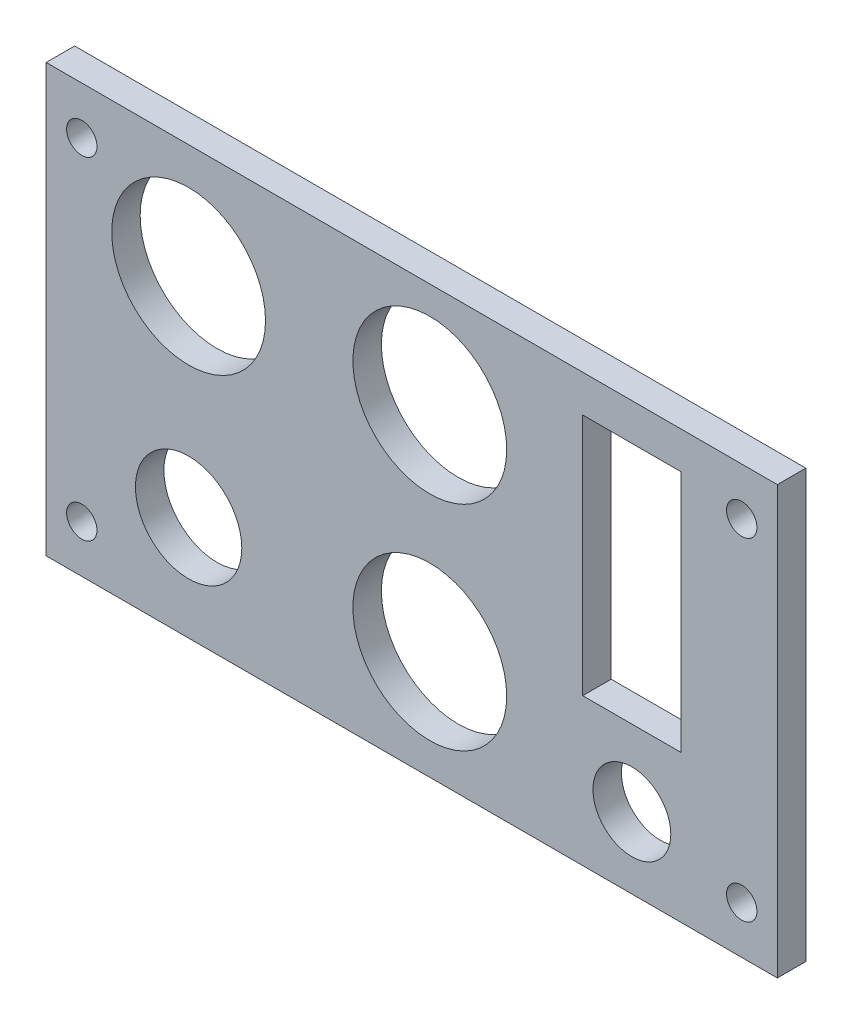
ISO-10303-21;
HEADER;
FILE_DESCRIPTION(('STEP AP214'),'2;1');
FILE_NAME('part.step','',(''),(''),'','','');
FILE_SCHEMA(('AUTOMOTIVE_DESIGN { 1 0 10303 214 1 1 1 1 }'));
ENDSEC;
DATA;
#1=APPLICATION_CONTEXT('core data for automotive mechanical design processes');
#2=APPLICATION_PROTOCOL_DEFINITION('international standard','automotive_design',2000,#1);
#3=PRODUCT_CONTEXT('',#1,'mechanical');
#4=PRODUCT('Part','Part','',(#3));
#5=PRODUCT_RELATED_PRODUCT_CATEGORY('part','',(#4));
#6=PRODUCT_DEFINITION_FORMATION('','',#4);
#7=PRODUCT_DEFINITION_CONTEXT('part definition',#1,'design');
#8=PRODUCT_DEFINITION('design','',#6,#7);
#9=PRODUCT_DEFINITION_SHAPE('','',#8);
#10=(LENGTH_UNIT() NAMED_UNIT(*) SI_UNIT(.MILLI.,.METRE.));
#11=(NAMED_UNIT(*) PLANE_ANGLE_UNIT() SI_UNIT($,.RADIAN.));
#12=(NAMED_UNIT(*) SI_UNIT($,.STERADIAN.) SOLID_ANGLE_UNIT());
#13=UNCERTAINTY_MEASURE_WITH_UNIT(LENGTH_MEASURE(1.E-05),#10,'distance_accuracy_value','');
#14=(GEOMETRIC_REPRESENTATION_CONTEXT(3) GLOBAL_UNCERTAINTY_ASSIGNED_CONTEXT((#13)) GLOBAL_UNIT_ASSIGNED_CONTEXT((#10,
#11,#12)) REPRESENTATION_CONTEXT('',''));
#15=CARTESIAN_POINT('',(0.,0.,0.));
#16=DIRECTION('',(0.,0.,1.));
#17=DIRECTION('',(1.,0.,0.));
#18=AXIS2_PLACEMENT_3D('',#15,#16,#17);
#19=CARTESIAN_POINT('',(0.,0.,3.));
#20=DIRECTION('',(1.,0.,0.));
#21=DIRECTION('',(0.,0.,-1.));
#22=AXIS2_PLACEMENT_3D('',#19,#20,#21);
#23=PLANE('',#22);
#24=DIRECTION('',(0.,-1.,0.));
#25=VECTOR('',#24,1.);
#26=CARTESIAN_POINT('',(0.,0.,0.));
#27=LINE('',#26,#25);
#28=CARTESIAN_POINT('',(0.,45.,0.));
#29=VERTEX_POINT('',#28);
#30=CARTESIAN_POINT('',(0.,0.,0.));
#31=VERTEX_POINT('',#30);
#32=EDGE_CURVE('E140',#29,#31,#27,.T.);
#33=ORIENTED_EDGE('',*,*,#32,.T.);
#34=DIRECTION('',(0.,0.,-1.));
#35=VECTOR('',#34,1.);
#36=CARTESIAN_POINT('',(0.,0.,3.));
#37=LINE('',#36,#35);
#38=CARTESIAN_POINT('',(0.,0.,3.));
#39=VERTEX_POINT('',#38);
#40=EDGE_CURVE('E11',#39,#31,#37,.T.);
#41=ORIENTED_EDGE('',*,*,#40,.F.);
#42=DIRECTION('',(0.,-1.,0.));
#43=VECTOR('',#42,1.);
#44=CARTESIAN_POINT('',(0.,0.,3.));
#45=LINE('',#44,#43);
#46=CARTESIAN_POINT('',(0.,45.,3.));
#47=VERTEX_POINT('',#46);
#48=EDGE_CURVE('E143',#47,#39,#45,.T.);
#49=ORIENTED_EDGE('',*,*,#48,.F.);
#50=DIRECTION('',(0.,0.,-1.));
#51=VECTOR('',#50,1.);
#52=CARTESIAN_POINT('',(0.,45.,3.));
#53=LINE('',#52,#51);
#54=EDGE_CURVE('E153',#47,#29,#53,.T.);
#55=ORIENTED_EDGE('',*,*,#54,.T.);
#56=EDGE_LOOP('',(#33,#41,#49,#55));
#57=FACE_BOUND('',#56,.T.);
#58=ADVANCED_FACE('F32',(#57),#23,.F.);
#59=CARTESIAN_POINT('',(0.,0.,3.));
#60=DIRECTION('',(0.,1.,0.));
#61=DIRECTION('',(0.,0.,1.));
#62=AXIS2_PLACEMENT_3D('',#59,#60,#61);
#63=PLANE('',#62);
#64=DIRECTION('',(1.,0.,0.));
#65=VECTOR('',#64,1.);
#66=CARTESIAN_POINT('',(0.,0.,0.));
#67=LINE('',#66,#65);
#68=CARTESIAN_POINT('',(77.,0.,0.));
#69=VERTEX_POINT('',#68);
#70=EDGE_CURVE('E156',#31,#69,#67,.T.);
#71=ORIENTED_EDGE('',*,*,#70,.T.);
#72=DIRECTION('',(0.,0.,-1.));
#73=VECTOR('',#72,1.);
#74=CARTESIAN_POINT('',(77.,0.,3.));
#75=LINE('',#74,#73);
#76=CARTESIAN_POINT('',(77.,0.,3.));
#77=VERTEX_POINT('',#76);
#78=EDGE_CURVE('E39',#77,#69,#75,.T.);
#79=ORIENTED_EDGE('',*,*,#78,.F.);
#80=DIRECTION('',(1.,0.,0.));
#81=VECTOR('',#80,1.);
#82=CARTESIAN_POINT('',(0.,0.,3.));
#83=LINE('',#82,#81);
#84=EDGE_CURVE('E146',#39,#77,#83,.T.);
#85=ORIENTED_EDGE('',*,*,#84,.F.);
#86=ORIENTED_EDGE('',*,*,#40,.T.);
#87=EDGE_LOOP('',(#71,#79,#85,#86));
#88=FACE_BOUND('',#87,.T.);
#89=ADVANCED_FACE('F185',(#88),#63,.F.);
#90=CARTESIAN_POINT('',(77.,0.,3.));
#91=DIRECTION('',(-1.,0.,0.));
#92=DIRECTION('',(0.,-1.,0.));
#93=AXIS2_PLACEMENT_3D('',#90,#91,#92);
#94=PLANE('',#93);
#95=DIRECTION('',(0.,1.,0.));
#96=VECTOR('',#95,1.);
#97=CARTESIAN_POINT('',(77.,0.,0.));
#98=LINE('',#97,#96);
#99=CARTESIAN_POINT('',(77.,45.,0.));
#100=VERTEX_POINT('',#99);
#101=EDGE_CURVE('E158',#69,#100,#98,.T.);
#102=ORIENTED_EDGE('',*,*,#101,.T.);
#103=DIRECTION('',(0.,0.,-1.));
#104=VECTOR('',#103,1.);
#105=CARTESIAN_POINT('',(77.,45.,3.));
#106=LINE('',#105,#104);
#107=CARTESIAN_POINT('',(77.,45.,3.));
#108=VERTEX_POINT('',#107);
#109=EDGE_CURVE('E163',#108,#100,#106,.T.);
#110=ORIENTED_EDGE('',*,*,#109,.F.);
#111=DIRECTION('',(0.,1.,0.));
#112=VECTOR('',#111,1.);
#113=CARTESIAN_POINT('',(77.,0.,3.));
#114=LINE('',#113,#112);
#115=EDGE_CURVE('E149',#77,#108,#114,.T.);
#116=ORIENTED_EDGE('',*,*,#115,.F.);
#117=ORIENTED_EDGE('',*,*,#78,.T.);
#118=EDGE_LOOP('',(#102,#110,#116,#117));
#119=FACE_BOUND('',#118,.T.);
#120=ADVANCED_FACE('F170',(#119),#94,.F.);
#121=CARTESIAN_POINT('',(0.,45.,3.));
#122=DIRECTION('',(0.,-1.,0.));
#123=DIRECTION('',(0.,0.,-1.));
#124=AXIS2_PLACEMENT_3D('',#121,#122,#123);
#125=PLANE('',#124);
#126=DIRECTION('',(-1.,0.,0.));
#127=VECTOR('',#126,1.);
#128=CARTESIAN_POINT('',(0.,45.,0.));
#129=LINE('',#128,#127);
#130=EDGE_CURVE('E147',#100,#29,#129,.T.);
#131=ORIENTED_EDGE('',*,*,#130,.T.);
#132=ORIENTED_EDGE('',*,*,#54,.F.);
#133=DIRECTION('',(-1.,0.,0.));
#134=VECTOR('',#133,1.);
#135=CARTESIAN_POINT('',(0.,45.,3.));
#136=LINE('',#135,#134);
#137=EDGE_CURVE('E151',#108,#47,#136,.T.);
#138=ORIENTED_EDGE('',*,*,#137,.F.);
#139=ORIENTED_EDGE('',*,*,#109,.T.);
#140=EDGE_LOOP('',(#131,#132,#138,#139));
#141=FACE_BOUND('',#140,.T.);
#142=ADVANCED_FACE('F178',(#141),#125,.F.);
#143=CARTESIAN_POINT('',(0.,45.,3.));
#144=DIRECTION('',(0.,0.,-1.));
#145=DIRECTION('',(-1.,0.,0.));
#146=AXIS2_PLACEMENT_3D('',#143,#144,#145);
#147=PLANE('',#146);
#148=CARTESIAN_POINT('',(3.74999999999999,40.,3.));
#149=DIRECTION('',(0.,0.,1.));
#150=DIRECTION('',(1.,0.,0.));
#151=AXIS2_PLACEMENT_3D('',#148,#149,#150);
#152=CIRCLE('',#151,1.6);
#153=CARTESIAN_POINT('',(5.34999999999999,40.,3.));
#154=VERTEX_POINT('',#153);
#155=EDGE_CURVE('E256',#154,#154,#152,.T.);
#156=ORIENTED_EDGE('',*,*,#155,.F.);
#157=EDGE_LOOP('',(#156));
#158=FACE_BOUND('',#157,.T.);
#159=CARTESIAN_POINT('',(3.74999999999999,4.99999999999999,3.));
#160=DIRECTION('',(0.,0.,1.));
#161=DIRECTION('',(1.,0.,0.));
#162=AXIS2_PLACEMENT_3D('',#159,#160,#161);
#163=CIRCLE('',#162,1.6);
#164=CARTESIAN_POINT('',(5.34999999999999,4.99999999999999,3.));
#165=VERTEX_POINT('',#164);
#166=EDGE_CURVE('E260',#165,#165,#163,.T.);
#167=ORIENTED_EDGE('',*,*,#166,.F.);
#168=EDGE_LOOP('',(#167));
#169=FACE_BOUND('',#168,.T.);
#170=CARTESIAN_POINT('',(73.25,4.99999999999999,3.));
#171=DIRECTION('',(0.,0.,1.));
#172=DIRECTION('',(1.,0.,0.));
#173=AXIS2_PLACEMENT_3D('',#170,#171,#172);
#174=CIRCLE('',#173,1.60000000000001);
#175=CARTESIAN_POINT('',(74.85,4.99999999999999,3.));
#176=VERTEX_POINT('',#175);
#177=EDGE_CURVE('E267',#176,#176,#174,.T.);
#178=ORIENTED_EDGE('',*,*,#177,.F.);
#179=EDGE_LOOP('',(#178));
#180=FACE_BOUND('',#179,.T.);
#181=CARTESIAN_POINT('',(73.25,40.,3.));
#182=DIRECTION('',(0.,0.,1.));
#183=DIRECTION('',(1.,0.,0.));
#184=AXIS2_PLACEMENT_3D('',#181,#182,#183);
#185=CIRCLE('',#184,1.60000000000001);
#186=CARTESIAN_POINT('',(74.85,40.,3.));
#187=VERTEX_POINT('',#186);
#188=EDGE_CURVE('E273',#187,#187,#185,.T.);
#189=ORIENTED_EDGE('',*,*,#188,.F.);
#190=EDGE_LOOP('',(#189));
#191=FACE_BOUND('',#190,.T.);
#192=CARTESIAN_POINT('',(40.4,11.45,3.));
#193=DIRECTION('',(0.,0.,1.));
#194=DIRECTION('',(1.,0.,0.));
#195=AXIS2_PLACEMENT_3D('',#192,#193,#194);
#196=CIRCLE('',#195,8.1);
#197=CARTESIAN_POINT('',(48.5,11.45,3.));
#198=VERTEX_POINT('',#197);
#199=EDGE_CURVE('E279',#198,#198,#196,.T.);
#200=ORIENTED_EDGE('',*,*,#199,.F.);
#201=EDGE_LOOP('',(#200));
#202=FACE_BOUND('',#201,.T.);
#203=CARTESIAN_POINT('',(40.4,33.95,3.));
#204=DIRECTION('',(0.,0.,1.));
#205=DIRECTION('',(1.,0.,0.));
#206=AXIS2_PLACEMENT_3D('',#203,#204,#205);
#207=CIRCLE('',#206,8.1);
#208=CARTESIAN_POINT('',(48.5,33.95,3.));
#209=VERTEX_POINT('',#208);
#210=EDGE_CURVE('E285',#209,#209,#207,.T.);
#211=ORIENTED_EDGE('',*,*,#210,.F.);
#212=EDGE_LOOP('',(#211));
#213=FACE_BOUND('',#212,.T.);
#214=CARTESIAN_POINT('',(61.68,7.5,3.));
#215=DIRECTION('',(0.,0.,1.));
#216=DIRECTION('',(1.,0.,0.));
#217=AXIS2_PLACEMENT_3D('',#214,#215,#216);
#218=CIRCLE('',#217,4.1);
#219=CARTESIAN_POINT('',(65.78,7.5,3.));
#220=VERTEX_POINT('',#219);
#221=EDGE_CURVE('E291',#220,#220,#218,.T.);
#222=ORIENTED_EDGE('',*,*,#221,.F.);
#223=EDGE_LOOP('',(#222));
#224=FACE_BOUND('',#223,.T.);
#225=DIRECTION('',(-1.,0.,0.));
#226=VECTOR('',#225,1.);
#227=CARTESIAN_POINT('',(66.86,41.1,3.));
#228=LINE('',#227,#226);
#229=CARTESIAN_POINT('',(66.86,41.1,3.));
#230=VERTEX_POINT('',#229);
#231=CARTESIAN_POINT('',(56.5,41.1,3.));
#232=VERTEX_POINT('',#231);
#233=EDGE_CURVE('E115',#230,#232,#228,.T.);
#234=ORIENTED_EDGE('',*,*,#233,.F.);
#235=DIRECTION('',(0.,1.,0.));
#236=VECTOR('',#235,1.);
#237=CARTESIAN_POINT('',(66.86,41.1,3.));
#238=LINE('',#237,#236);
#239=CARTESIAN_POINT('',(66.86,15.5,3.));
#240=VERTEX_POINT('',#239);
#241=EDGE_CURVE('E46',#240,#230,#238,.T.);
#242=ORIENTED_EDGE('',*,*,#241,.F.);
#243=DIRECTION('',(1.,0.,0.));
#244=VECTOR('',#243,1.);
#245=CARTESIAN_POINT('',(66.86,15.5,3.));
#246=LINE('',#245,#244);
#247=CARTESIAN_POINT('',(56.5,15.5,3.));
#248=VERTEX_POINT('',#247);
#249=EDGE_CURVE('E108',#248,#240,#246,.T.);
#250=ORIENTED_EDGE('',*,*,#249,.F.);
#251=DIRECTION('',(0.,-1.,0.));
#252=VECTOR('',#251,1.);
#253=CARTESIAN_POINT('',(56.5,41.1,3.));
#254=LINE('',#253,#252);
#255=EDGE_CURVE('E122',#232,#248,#254,.T.);
#256=ORIENTED_EDGE('',*,*,#255,.F.);
#257=EDGE_LOOP('',(#234,#242,#250,#256));
#258=FACE_BOUND('',#257,.T.);
#259=CARTESIAN_POINT('',(15.,11.,3.));
#260=DIRECTION('',(0.,0.,1.));
#261=DIRECTION('',(1.,0.,0.));
#262=AXIS2_PLACEMENT_3D('',#259,#260,#261);
#263=CIRCLE('',#262,5.6);
#264=CARTESIAN_POINT('',(20.6,11.,3.));
#265=VERTEX_POINT('',#264);
#266=EDGE_CURVE('E131',#265,#265,#263,.T.);
#267=ORIENTED_EDGE('',*,*,#266,.F.);
#268=EDGE_LOOP('',(#267));
#269=FACE_BOUND('',#268,.T.);
#270=CARTESIAN_POINT('',(15.,33.,3.));
#271=DIRECTION('',(0.,0.,1.));
#272=DIRECTION('',(1.,0.,0.));
#273=AXIS2_PLACEMENT_3D('',#270,#271,#272);
#274=CIRCLE('',#273,8.1);
#275=CARTESIAN_POINT('',(23.1,33.,3.));
#276=VERTEX_POINT('',#275);
#277=EDGE_CURVE('E137',#276,#276,#274,.T.);
#278=ORIENTED_EDGE('',*,*,#277,.F.);
#279=EDGE_LOOP('',(#278));
#280=FACE_BOUND('',#279,.T.);
#281=ORIENTED_EDGE('',*,*,#48,.T.);
#282=ORIENTED_EDGE('',*,*,#84,.T.);
#283=ORIENTED_EDGE('',*,*,#115,.T.);
#284=ORIENTED_EDGE('',*,*,#137,.T.);
#285=EDGE_LOOP('',(#281,#282,#283,#284));
#286=FACE_BOUND('',#285,.T.);
#287=ADVANCED_FACE('F184',(#158,#169,#180,#191,#202,#213,#224,#258,#269,#280,#286),#147,.F.);
#288=CARTESIAN_POINT('',(0.,45.,0.));
#289=DIRECTION('',(0.,0.,-1.));
#290=DIRECTION('',(-1.,0.,0.));
#291=AXIS2_PLACEMENT_3D('',#288,#289,#290);
#292=PLANE('',#291);
#293=CARTESIAN_POINT('',(3.74999999999999,40.,0.));
#294=DIRECTION('',(0.,0.,-1.));
#295=DIRECTION('',(-1.,0.,0.));
#296=AXIS2_PLACEMENT_3D('',#293,#294,#295);
#297=CIRCLE('',#296,1.6);
#298=CARTESIAN_POINT('',(2.14999999999999,40.,0.));
#299=VERTEX_POINT('',#298);
#300=EDGE_CURVE('E253',#299,#299,#297,.F.);
#301=ORIENTED_EDGE('',*,*,#300,.T.);
#302=EDGE_LOOP('',(#301));
#303=FACE_BOUND('',#302,.T.);
#304=CARTESIAN_POINT('',(3.74999999999999,4.99999999999999,0.));
#305=DIRECTION('',(0.,0.,-1.));
#306=DIRECTION('',(-1.,0.,0.));
#307=AXIS2_PLACEMENT_3D('',#304,#305,#306);
#308=CIRCLE('',#307,1.6);
#309=CARTESIAN_POINT('',(2.14999999999999,4.99999999999999,0.));
#310=VERTEX_POINT('',#309);
#311=EDGE_CURVE('E257',#310,#310,#308,.F.);
#312=ORIENTED_EDGE('',*,*,#311,.T.);
#313=EDGE_LOOP('',(#312));
#314=FACE_BOUND('',#313,.T.);
#315=CARTESIAN_POINT('',(73.25,4.99999999999999,0.));
#316=DIRECTION('',(0.,0.,-1.));
#317=DIRECTION('',(-1.,0.,0.));
#318=AXIS2_PLACEMENT_3D('',#315,#316,#317);
#319=CIRCLE('',#318,1.60000000000001);
#320=CARTESIAN_POINT('',(71.65,4.99999999999999,0.));
#321=VERTEX_POINT('',#320);
#322=EDGE_CURVE('E265',#321,#321,#319,.F.);
#323=ORIENTED_EDGE('',*,*,#322,.T.);
#324=EDGE_LOOP('',(#323));
#325=FACE_BOUND('',#324,.T.);
#326=CARTESIAN_POINT('',(73.25,40.,0.));
#327=DIRECTION('',(0.,0.,-1.));
#328=DIRECTION('',(-1.,0.,0.));
#329=AXIS2_PLACEMENT_3D('',#326,#327,#328);
#330=CIRCLE('',#329,1.60000000000001);
#331=CARTESIAN_POINT('',(71.65,40.,0.));
#332=VERTEX_POINT('',#331);
#333=EDGE_CURVE('E270',#332,#332,#330,.F.);
#334=ORIENTED_EDGE('',*,*,#333,.T.);
#335=EDGE_LOOP('',(#334));
#336=FACE_BOUND('',#335,.T.);
#337=CARTESIAN_POINT('',(40.4,11.45,0.));
#338=DIRECTION('',(0.,0.,-1.));
#339=DIRECTION('',(-1.,0.,0.));
#340=AXIS2_PLACEMENT_3D('',#337,#338,#339);
#341=CIRCLE('',#340,8.1);
#342=CARTESIAN_POINT('',(32.3,11.45,0.));
#343=VERTEX_POINT('',#342);
#344=EDGE_CURVE('E276',#343,#343,#341,.F.);
#345=ORIENTED_EDGE('',*,*,#344,.T.);
#346=EDGE_LOOP('',(#345));
#347=FACE_BOUND('',#346,.T.);
#348=CARTESIAN_POINT('',(40.4,33.95,0.));
#349=DIRECTION('',(0.,0.,-1.));
#350=DIRECTION('',(-1.,0.,0.));
#351=AXIS2_PLACEMENT_3D('',#348,#349,#350);
#352=CIRCLE('',#351,8.1);
#353=CARTESIAN_POINT('',(32.3,33.95,0.));
#354=VERTEX_POINT('',#353);
#355=EDGE_CURVE('E282',#354,#354,#352,.F.);
#356=ORIENTED_EDGE('',*,*,#355,.T.);
#357=EDGE_LOOP('',(#356));
#358=FACE_BOUND('',#357,.T.);
#359=CARTESIAN_POINT('',(61.68,7.5,0.));
#360=DIRECTION('',(0.,0.,-1.));
#361=DIRECTION('',(-1.,0.,0.));
#362=AXIS2_PLACEMENT_3D('',#359,#360,#361);
#363=CIRCLE('',#362,4.1);
#364=CARTESIAN_POINT('',(57.58,7.5,0.));
#365=VERTEX_POINT('',#364);
#366=EDGE_CURVE('E288',#365,#365,#363,.F.);
#367=ORIENTED_EDGE('',*,*,#366,.T.);
#368=EDGE_LOOP('',(#367));
#369=FACE_BOUND('',#368,.T.);
#370=DIRECTION('',(0.,1.,0.));
#371=VECTOR('',#370,1.);
#372=CARTESIAN_POINT('',(66.86,41.1,0.));
#373=LINE('',#372,#371);
#374=CARTESIAN_POINT('',(66.86,15.5,0.));
#375=VERTEX_POINT('',#374);
#376=CARTESIAN_POINT('',(66.86,41.1,0.));
#377=VERTEX_POINT('',#376);
#378=EDGE_CURVE('E106',#375,#377,#373,.T.);
#379=ORIENTED_EDGE('',*,*,#378,.T.);
#380=DIRECTION('',(-1.,0.,0.));
#381=VECTOR('',#380,1.);
#382=CARTESIAN_POINT('',(66.86,41.1,0.));
#383=LINE('',#382,#381);
#384=CARTESIAN_POINT('',(56.5,41.1,0.));
#385=VERTEX_POINT('',#384);
#386=EDGE_CURVE('E95',#377,#385,#383,.T.);
#387=ORIENTED_EDGE('',*,*,#386,.T.);
#388=DIRECTION('',(0.,-1.,0.));
#389=VECTOR('',#388,1.);
#390=CARTESIAN_POINT('',(56.5,41.1,0.));
#391=LINE('',#390,#389);
#392=CARTESIAN_POINT('',(56.5,15.5,0.));
#393=VERTEX_POINT('',#392);
#394=EDGE_CURVE('E117',#385,#393,#391,.T.);
#395=ORIENTED_EDGE('',*,*,#394,.T.);
#396=DIRECTION('',(1.,0.,0.));
#397=VECTOR('',#396,1.);
#398=CARTESIAN_POINT('',(66.86,15.5,0.));
#399=LINE('',#398,#397);
#400=EDGE_CURVE('E113',#393,#375,#399,.T.);
#401=ORIENTED_EDGE('',*,*,#400,.T.);
#402=EDGE_LOOP('',(#379,#387,#395,#401));
#403=FACE_BOUND('',#402,.T.);
#404=CARTESIAN_POINT('',(15.,11.,0.));
#405=DIRECTION('',(0.,0.,-1.));
#406=DIRECTION('',(-1.,0.,0.));
#407=AXIS2_PLACEMENT_3D('',#404,#405,#406);
#408=CIRCLE('',#407,5.6);
#409=CARTESIAN_POINT('',(9.40000000000001,11.,0.));
#410=VERTEX_POINT('',#409);
#411=EDGE_CURVE('E102',#410,#410,#408,.F.);
#412=ORIENTED_EDGE('',*,*,#411,.T.);
#413=EDGE_LOOP('',(#412));
#414=FACE_BOUND('',#413,.T.);
#415=CARTESIAN_POINT('',(15.,33.,0.));
#416=DIRECTION('',(0.,0.,-1.));
#417=DIRECTION('',(-1.,0.,0.));
#418=AXIS2_PLACEMENT_3D('',#415,#416,#417);
#419=CIRCLE('',#418,8.1);
#420=CARTESIAN_POINT('',(6.9,33.,0.));
#421=VERTEX_POINT('',#420);
#422=EDGE_CURVE('E134',#421,#421,#419,.F.);
#423=ORIENTED_EDGE('',*,*,#422,.T.);
#424=EDGE_LOOP('',(#423));
#425=FACE_BOUND('',#424,.T.);
#426=ORIENTED_EDGE('',*,*,#32,.F.);
#427=ORIENTED_EDGE('',*,*,#130,.F.);
#428=ORIENTED_EDGE('',*,*,#101,.F.);
#429=ORIENTED_EDGE('',*,*,#70,.F.);
#430=EDGE_LOOP('',(#426,#427,#428,#429));
#431=FACE_BOUND('',#430,.T.);
#432=ADVANCED_FACE('F111',(#303,#314,#325,#336,#347,#358,#369,#403,#414,#425,#431),#292,.T.);
#433=CARTESIAN_POINT('',(15.,33.,-0.00100000000000013));
#434=DIRECTION('',(0.,0.,1.));
#435=DIRECTION('',(1.,0.,0.));
#436=AXIS2_PLACEMENT_3D('',#433,#434,#435);
#437=CYLINDRICAL_SURFACE('',#436,8.1);
#438=ORIENTED_EDGE('',*,*,#422,.F.);
#439=EDGE_LOOP('',(#438));
#440=FACE_BOUND('',#439,.T.);
#441=ORIENTED_EDGE('',*,*,#277,.T.);
#442=EDGE_LOOP('',(#441));
#443=FACE_BOUND('',#442,.T.);
#444=ADVANCED_FACE('F197',(#440,#443),#437,.F.);
#445=CARTESIAN_POINT('',(15.,11.,-0.00100000000000013));
#446=DIRECTION('',(0.,0.,1.));
#447=DIRECTION('',(1.,0.,0.));
#448=AXIS2_PLACEMENT_3D('',#445,#446,#447);
#449=CYLINDRICAL_SURFACE('',#448,5.6);
#450=ORIENTED_EDGE('',*,*,#411,.F.);
#451=EDGE_LOOP('',(#450));
#452=FACE_BOUND('',#451,.T.);
#453=ORIENTED_EDGE('',*,*,#266,.T.);
#454=EDGE_LOOP('',(#453));
#455=FACE_BOUND('',#454,.T.);
#456=ADVANCED_FACE('F204',(#452,#455),#449,.F.);
#457=CARTESIAN_POINT('',(66.86,41.1,-0.00100000000000013));
#458=DIRECTION('',(1.,0.,0.));
#459=DIRECTION('',(0.,0.,-1.));
#460=AXIS2_PLACEMENT_3D('',#457,#458,#459);
#461=PLANE('',#460);
#462=DIRECTION('',(0.,0.,1.));
#463=VECTOR('',#462,1.);
#464=CARTESIAN_POINT('',(66.86,15.5,-0.00100000000000013));
#465=LINE('',#464,#463);
#466=EDGE_CURVE('E103',#375,#240,#465,.T.);
#467=ORIENTED_EDGE('',*,*,#466,.T.);
#468=ORIENTED_EDGE('',*,*,#241,.T.);
#469=DIRECTION('',(0.,0.,1.));
#470=VECTOR('',#469,1.);
#471=CARTESIAN_POINT('',(66.86,41.1,-0.00100000000000013));
#472=LINE('',#471,#470);
#473=EDGE_CURVE('E97',#377,#230,#472,.T.);
#474=ORIENTED_EDGE('',*,*,#473,.F.);
#475=ORIENTED_EDGE('',*,*,#378,.F.);
#476=EDGE_LOOP('',(#467,#468,#474,#475));
#477=FACE_BOUND('',#476,.T.);
#478=ADVANCED_FACE('F105',(#477),#461,.F.);
#479=CARTESIAN_POINT('',(66.86,15.5,-0.00100000000000013));
#480=DIRECTION('',(0.,-1.,0.));
#481=DIRECTION('',(0.,0.,-1.));
#482=AXIS2_PLACEMENT_3D('',#479,#480,#481);
#483=PLANE('',#482);
#484=DIRECTION('',(0.,0.,1.));
#485=VECTOR('',#484,1.);
#486=CARTESIAN_POINT('',(56.5,15.5,-0.00100000000000013));
#487=LINE('',#486,#485);
#488=EDGE_CURVE('E128',#393,#248,#487,.T.);
#489=ORIENTED_EDGE('',*,*,#488,.T.);
#490=ORIENTED_EDGE('',*,*,#249,.T.);
#491=ORIENTED_EDGE('',*,*,#466,.F.);
#492=ORIENTED_EDGE('',*,*,#400,.F.);
#493=EDGE_LOOP('',(#489,#490,#491,#492));
#494=FACE_BOUND('',#493,.T.);
#495=ADVANCED_FACE('F211',(#494),#483,.F.);
#496=CARTESIAN_POINT('',(56.5,41.1,-0.00100000000000013));
#497=DIRECTION('',(-1.,0.,0.));
#498=DIRECTION('',(0.,0.,1.));
#499=AXIS2_PLACEMENT_3D('',#496,#497,#498);
#500=PLANE('',#499);
#501=DIRECTION('',(0.,0.,1.));
#502=VECTOR('',#501,1.);
#503=CARTESIAN_POINT('',(56.5,41.1,-0.00100000000000013));
#504=LINE('',#503,#502);
#505=EDGE_CURVE('E54',#385,#232,#504,.T.);
#506=ORIENTED_EDGE('',*,*,#505,.T.);
#507=ORIENTED_EDGE('',*,*,#255,.T.);
#508=ORIENTED_EDGE('',*,*,#488,.F.);
#509=ORIENTED_EDGE('',*,*,#394,.F.);
#510=EDGE_LOOP('',(#506,#507,#508,#509));
#511=FACE_BOUND('',#510,.T.);
#512=ADVANCED_FACE('F215',(#511),#500,.F.);
#513=CARTESIAN_POINT('',(66.86,41.1,-0.00100000000000013));
#514=DIRECTION('',(0.,1.,0.));
#515=DIRECTION('',(0.,0.,1.));
#516=AXIS2_PLACEMENT_3D('',#513,#514,#515);
#517=PLANE('',#516);
#518=ORIENTED_EDGE('',*,*,#473,.T.);
#519=ORIENTED_EDGE('',*,*,#233,.T.);
#520=ORIENTED_EDGE('',*,*,#505,.F.);
#521=ORIENTED_EDGE('',*,*,#386,.F.);
#522=EDGE_LOOP('',(#518,#519,#520,#521));
#523=FACE_BOUND('',#522,.T.);
#524=ADVANCED_FACE('F96',(#523),#517,.F.);
#525=CARTESIAN_POINT('',(61.68,7.5,-0.00100000000000013));
#526=DIRECTION('',(0.,0.,1.));
#527=DIRECTION('',(1.,0.,0.));
#528=AXIS2_PLACEMENT_3D('',#525,#526,#527);
#529=CYLINDRICAL_SURFACE('',#528,4.1);
#530=ORIENTED_EDGE('',*,*,#366,.F.);
#531=EDGE_LOOP('',(#530));
#532=FACE_BOUND('',#531,.T.);
#533=ORIENTED_EDGE('',*,*,#221,.T.);
#534=EDGE_LOOP('',(#533));
#535=FACE_BOUND('',#534,.T.);
#536=ADVANCED_FACE('F214',(#532,#535),#529,.F.);
#537=CARTESIAN_POINT('',(40.4,33.95,-0.00100000000000013));
#538=DIRECTION('',(0.,0.,1.));
#539=DIRECTION('',(1.,0.,0.));
#540=AXIS2_PLACEMENT_3D('',#537,#538,#539);
#541=CYLINDRICAL_SURFACE('',#540,8.1);
#542=ORIENTED_EDGE('',*,*,#355,.F.);
#543=EDGE_LOOP('',(#542));
#544=FACE_BOUND('',#543,.T.);
#545=ORIENTED_EDGE('',*,*,#210,.T.);
#546=EDGE_LOOP('',(#545));
#547=FACE_BOUND('',#546,.T.);
#548=ADVANCED_FACE('F224',(#544,#547),#541,.F.);
#549=CARTESIAN_POINT('',(40.4,11.45,-0.00100000000000013));
#550=DIRECTION('',(0.,0.,1.));
#551=DIRECTION('',(1.,0.,0.));
#552=AXIS2_PLACEMENT_3D('',#549,#550,#551);
#553=CYLINDRICAL_SURFACE('',#552,8.1);
#554=ORIENTED_EDGE('',*,*,#344,.F.);
#555=EDGE_LOOP('',(#554));
#556=FACE_BOUND('',#555,.T.);
#557=ORIENTED_EDGE('',*,*,#199,.T.);
#558=EDGE_LOOP('',(#557));
#559=FACE_BOUND('',#558,.T.);
#560=ADVANCED_FACE('F228',(#556,#559),#553,.F.);
#561=CARTESIAN_POINT('',(73.25,40.,-0.00100000000000013));
#562=DIRECTION('',(0.,0.,1.));
#563=DIRECTION('',(1.,0.,0.));
#564=AXIS2_PLACEMENT_3D('',#561,#562,#563);
#565=CYLINDRICAL_SURFACE('',#564,1.60000000000001);
#566=ORIENTED_EDGE('',*,*,#333,.F.);
#567=EDGE_LOOP('',(#566));
#568=FACE_BOUND('',#567,.T.);
#569=ORIENTED_EDGE('',*,*,#188,.T.);
#570=EDGE_LOOP('',(#569));
#571=FACE_BOUND('',#570,.T.);
#572=ADVANCED_FACE('F232',(#568,#571),#565,.F.);
#573=CARTESIAN_POINT('',(73.25,4.99999999999999,-0.00100000000000013));
#574=DIRECTION('',(0.,0.,1.));
#575=DIRECTION('',(1.,0.,0.));
#576=AXIS2_PLACEMENT_3D('',#573,#574,#575);
#577=CYLINDRICAL_SURFACE('',#576,1.60000000000001);
#578=ORIENTED_EDGE('',*,*,#322,.F.);
#579=EDGE_LOOP('',(#578));
#580=FACE_BOUND('',#579,.T.);
#581=ORIENTED_EDGE('',*,*,#177,.T.);
#582=EDGE_LOOP('',(#581));
#583=FACE_BOUND('',#582,.T.);
#584=ADVANCED_FACE('F236',(#580,#583),#577,.F.);
#585=CARTESIAN_POINT('',(3.74999999999999,4.99999999999999,-0.00100000000000013));
#586=DIRECTION('',(0.,0.,1.));
#587=DIRECTION('',(1.,0.,0.));
#588=AXIS2_PLACEMENT_3D('',#585,#586,#587);
#589=CYLINDRICAL_SURFACE('',#588,1.6);
#590=ORIENTED_EDGE('',*,*,#311,.F.);
#591=EDGE_LOOP('',(#590));
#592=FACE_BOUND('',#591,.T.);
#593=ORIENTED_EDGE('',*,*,#166,.T.);
#594=EDGE_LOOP('',(#593));
#595=FACE_BOUND('',#594,.T.);
#596=ADVANCED_FACE('F240',(#592,#595),#589,.F.);
#597=CARTESIAN_POINT('',(3.74999999999999,40.,-0.00100000000000013));
#598=DIRECTION('',(0.,0.,1.));
#599=DIRECTION('',(1.,0.,0.));
#600=AXIS2_PLACEMENT_3D('',#597,#598,#599);
#601=CYLINDRICAL_SURFACE('',#600,1.6);
#602=ORIENTED_EDGE('',*,*,#300,.F.);
#603=EDGE_LOOP('',(#602));
#604=FACE_BOUND('',#603,.T.);
#605=ORIENTED_EDGE('',*,*,#155,.T.);
#606=EDGE_LOOP('',(#605));
#607=FACE_BOUND('',#606,.T.);
#608=ADVANCED_FACE('F244',(#604,#607),#601,.F.);
#609=CLOSED_SHELL('',(#58,#89,#120,#142,#287,#432,#444,#456,#478,#495,#512,#524,#536,#548,#560,
#572,#584,#596,#608));
#610=MANIFOLD_SOLID_BREP('B2',#609);
#611=ADVANCED_BREP_SHAPE_REPRESENTATION('',(#18,#610),#14);
#612=SHAPE_DEFINITION_REPRESENTATION(#9,#611);
ENDSEC;
END-ISO-10303-21;
